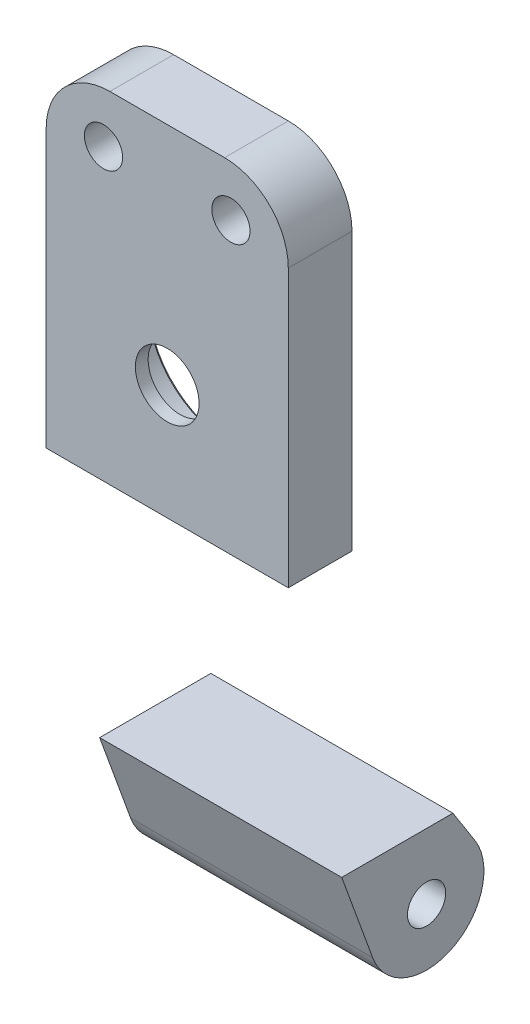
ISO-10303-21;
HEADER;
FILE_DESCRIPTION(('STEP AP214'),'2;1');
FILE_NAME('part.step','',(''),(''),'','','');
FILE_SCHEMA(('AUTOMOTIVE_DESIGN { 1 0 10303 214 1 1 1 1 }'));
ENDSEC;
DATA;
#1=APPLICATION_CONTEXT('core data for automotive mechanical design processes');
#2=APPLICATION_PROTOCOL_DEFINITION('international standard','automotive_design',2000,#1);
#3=PRODUCT_CONTEXT('',#1,'mechanical');
#4=PRODUCT('Part','Part','',(#3));
#5=PRODUCT_RELATED_PRODUCT_CATEGORY('part','',(#4));
#6=PRODUCT_DEFINITION_FORMATION('','',#4);
#7=PRODUCT_DEFINITION_CONTEXT('part definition',#1,'design');
#8=PRODUCT_DEFINITION('design','',#6,#7);
#9=PRODUCT_DEFINITION_SHAPE('','',#8);
#10=(LENGTH_UNIT() NAMED_UNIT(*) SI_UNIT(.MILLI.,.METRE.));
#11=(NAMED_UNIT(*) PLANE_ANGLE_UNIT() SI_UNIT($,.RADIAN.));
#12=(NAMED_UNIT(*) SI_UNIT($,.STERADIAN.) SOLID_ANGLE_UNIT());
#13=UNCERTAINTY_MEASURE_WITH_UNIT(LENGTH_MEASURE(1.E-05),#10,'distance_accuracy_value','');
#14=(GEOMETRIC_REPRESENTATION_CONTEXT(3) GLOBAL_UNCERTAINTY_ASSIGNED_CONTEXT((#13)) GLOBAL_UNIT_ASSIGNED_CONTEXT((#10,
#11,#12)) REPRESENTATION_CONTEXT('',''));
#15=CARTESIAN_POINT('',(0.,0.,0.));
#16=DIRECTION('',(0.,0.,1.));
#17=DIRECTION('',(1.,0.,0.));
#18=AXIS2_PLACEMENT_3D('',#15,#16,#17);
#19=CARTESIAN_POINT('',(9.5,1.73141540514422,17.5374143015117));
#20=DIRECTION('',(1.,0.,0.));
#21=DIRECTION('',(0.,1.,0.));
#22=AXIS2_PLACEMENT_3D('',#19,#20,#21);
#23=PLANE('',#22);
#24=DIRECTION('',(0.,0.,1.));
#25=VECTOR('',#24,1.);
#26=CARTESIAN_POINT('',(9.5,4.06933743514415,28.9300125427243));
#27=LINE('',#26,#25);
#28=CARTESIAN_POINT('',(9.5,4.06933743514415,20.2143094769658));
#29=VERTEX_POINT('',#28);
#30=CARTESIAN_POINT('',(9.5,4.06933743514415,25.2143094769658));
#31=VERTEX_POINT('',#30);
#32=EDGE_CURVE('E12',#29,#31,#27,.T.);
#33=ORIENTED_EDGE('',*,*,#32,.F.);
#34=DIRECTION('',(0.,-1.,0.));
#35=VECTOR('',#34,1.);
#36=CARTESIAN_POINT('',(9.5,7.91732382523638,20.2143094769658));
#37=LINE('',#36,#35);
#38=CARTESIAN_POINT('',(9.5,25.8080822959938,20.2143094769658));
#39=VERTEX_POINT('',#38);
#40=EDGE_CURVE('E111',#39,#29,#37,.T.);
#41=ORIENTED_EDGE('',*,*,#40,.F.);
#42=DIRECTION('',(0.,0.,1.));
#43=VECTOR('',#42,1.);
#44=CARTESIAN_POINT('',(9.5,25.8080822959938,17.5374143015117));
#45=LINE('',#44,#43);
#46=CARTESIAN_POINT('',(9.5,25.8080822959938,25.2143094769657));
#47=VERTEX_POINT('',#46);
#48=EDGE_CURVE('E131',#39,#47,#45,.T.);
#49=ORIENTED_EDGE('',*,*,#48,.T.);
#50=DIRECTION('',(0.,-1.,0.));
#51=VECTOR('',#50,1.);
#52=CARTESIAN_POINT('',(9.5,7.60659887027264,25.2143094769657));
#53=LINE('',#52,#51);
#54=EDGE_CURVE('E113',#47,#31,#53,.T.);
#55=ORIENTED_EDGE('',*,*,#54,.T.);
#56=EDGE_LOOP('',(#33,#41,#49,#55));
#57=FACE_BOUND('',#56,.T.);
#58=ADVANCED_FACE('F50',(#57),#23,.T.);
#59=CARTESIAN_POINT('',(-9.5,1.73141540514422,17.5374143015117));
#60=DIRECTION('',(1.,0.,0.));
#61=DIRECTION('',(0.,1.,0.));
#62=AXIS2_PLACEMENT_3D('',#59,#60,#61);
#63=PLANE('',#62);
#64=DIRECTION('',(0.,-1.,0.));
#65=VECTOR('',#64,1.);
#66=CARTESIAN_POINT('',(-9.5,7.91732382523638,20.2143094769658));
#67=LINE('',#66,#65);
#68=CARTESIAN_POINT('',(-9.5,25.8080822959938,20.2143094769658));
#69=VERTEX_POINT('',#68);
#70=CARTESIAN_POINT('',(-9.5,4.06933743514415,20.2143094769658));
#71=VERTEX_POINT('',#70);
#72=EDGE_CURVE('E128',#69,#71,#67,.T.);
#73=ORIENTED_EDGE('',*,*,#72,.T.);
#74=DIRECTION('',(0.,0.,1.));
#75=VECTOR('',#74,1.);
#76=CARTESIAN_POINT('',(-9.5,4.06933743514415,17.5374143015117));
#77=LINE('',#76,#75);
#78=CARTESIAN_POINT('',(-9.5,4.06933743514415,25.2143094769657));
#79=VERTEX_POINT('',#78);
#80=EDGE_CURVE('E100',#71,#79,#77,.T.);
#81=ORIENTED_EDGE('',*,*,#80,.T.);
#82=DIRECTION('',(0.,-1.,0.));
#83=VECTOR('',#82,1.);
#84=CARTESIAN_POINT('',(-9.5,7.60659887027264,25.2143094769657));
#85=LINE('',#84,#83);
#86=CARTESIAN_POINT('',(-9.5,25.8080822959938,25.2143094769657));
#87=VERTEX_POINT('',#86);
#88=EDGE_CURVE('E148',#87,#79,#85,.T.);
#89=ORIENTED_EDGE('',*,*,#88,.F.);
#90=DIRECTION('',(0.,0.,-1.));
#91=VECTOR('',#90,1.);
#92=CARTESIAN_POINT('',(-9.5,25.8080822959938,20.2143094769658));
#93=LINE('',#92,#91);
#94=EDGE_CURVE('E156',#87,#69,#93,.T.);
#95=ORIENTED_EDGE('',*,*,#94,.T.);
#96=EDGE_LOOP('',(#73,#81,#89,#95));
#97=FACE_BOUND('',#96,.T.);
#98=ADVANCED_FACE('F194',(#97),#63,.F.);
#99=CARTESIAN_POINT('',(0.,13.1015537091819,20.7143094769658));
#100=DIRECTION('',(0.,0.,-1.));
#101=DIRECTION('',(-1.,0.,0.));
#102=AXIS2_PLACEMENT_3D('',#99,#100,#101);
#103=CONICAL_SURFACE('',#102,6.,0.785398163397448);
#104=CARTESIAN_POINT('',(0.,13.1015537091819,20.2143094769658));
#105=DIRECTION('',(0.,0.,1.));
#106=DIRECTION('',(-1.,0.,0.));
#107=AXIS2_PLACEMENT_3D('',#104,#105,#106);
#108=CIRCLE('',#107,6.5);
#109=CARTESIAN_POINT('',(-6.5,13.1015537091819,20.2143094769658));
#110=VERTEX_POINT('',#109);
#111=EDGE_CURVE('E119',#110,#110,#108,.T.);
#112=ORIENTED_EDGE('',*,*,#111,.F.);
#113=EDGE_LOOP('',(#112));
#114=FACE_BOUND('',#113,.T.);
#115=CARTESIAN_POINT('',(0.,13.1015537091819,20.4643094769658));
#116=DIRECTION('',(0.,0.,-1.));
#117=DIRECTION('',(-1.,0.,0.));
#118=AXIS2_PLACEMENT_3D('',#115,#116,#117);
#119=CIRCLE('',#118,6.25);
#120=CARTESIAN_POINT('',(-6.25,13.1015537091819,20.4643094769658));
#121=VERTEX_POINT('',#120);
#122=EDGE_CURVE('E139',#121,#121,#119,.T.);
#123=ORIENTED_EDGE('',*,*,#122,.F.);
#124=EDGE_LOOP('',(#123));
#125=FACE_BOUND('',#124,.T.);
#126=ADVANCED_FACE('F196',(#114,#125),#103,.F.);
#127=CARTESIAN_POINT('',(9.5,7.60659887027264,25.2143094769657));
#128=DIRECTION('',(0.,0.,-1.));
#129=DIRECTION('',(-1.,0.,0.));
#130=AXIS2_PLACEMENT_3D('',#127,#128,#129);
#131=PLANE('',#130);
#132=CARTESIAN_POINT('',(-5.,26.8080822959938,25.2143094769657));
#133=DIRECTION('',(0.,0.,1.));
#134=DIRECTION('',(1.,0.,0.));
#135=AXIS2_PLACEMENT_3D('',#132,#133,#134);
#136=CIRCLE('',#135,1.5);
#137=CARTESIAN_POINT('',(-3.5,26.8080822959938,25.2143094769657));
#138=VERTEX_POINT('',#137);
#139=EDGE_CURVE('E107',#138,#138,#136,.T.);
#140=ORIENTED_EDGE('',*,*,#139,.F.);
#141=EDGE_LOOP('',(#140));
#142=FACE_BOUND('',#141,.T.);
#143=CARTESIAN_POINT('',(5.,26.8080822959938,25.2143094769657));
#144=DIRECTION('',(0.,0.,1.));
#145=DIRECTION('',(1.,0.,0.));
#146=AXIS2_PLACEMENT_3D('',#143,#144,#145);
#147=CIRCLE('',#146,1.5);
#148=CARTESIAN_POINT('',(6.5,26.8080822959938,25.2143094769657));
#149=VERTEX_POINT('',#148);
#150=EDGE_CURVE('E140',#149,#149,#147,.T.);
#151=ORIENTED_EDGE('',*,*,#150,.F.);
#152=EDGE_LOOP('',(#151));
#153=FACE_BOUND('',#152,.T.);
#154=CARTESIAN_POINT('',(0.,13.1015537091819,25.2143094769657));
#155=DIRECTION('',(0.,0.,-1.));
#156=DIRECTION('',(0.,1.,0.));
#157=AXIS2_PLACEMENT_3D('',#154,#155,#156);
#158=CIRCLE('',#157,2.5);
#159=CARTESIAN_POINT('',(0.,15.6015537091819,25.2143094769657));
#160=VERTEX_POINT('',#159);
#161=EDGE_CURVE('E152',#160,#160,#158,.T.);
#162=ORIENTED_EDGE('',*,*,#161,.T.);
#163=EDGE_LOOP('',(#162));
#164=FACE_BOUND('',#163,.T.);
#165=ORIENTED_EDGE('',*,*,#88,.T.);
#166=DIRECTION('',(1.,0.,0.));
#167=VECTOR('',#166,1.);
#168=CARTESIAN_POINT('',(9.5,4.06933743514415,25.2143094769657));
#169=LINE('',#168,#167);
#170=EDGE_CURVE('E65',#79,#31,#169,.T.);
#171=ORIENTED_EDGE('',*,*,#170,.T.);
#172=ORIENTED_EDGE('',*,*,#54,.F.);
#173=CARTESIAN_POINT('',(4.5,25.8080822959938,25.2143094769657));
#174=DIRECTION('',(0.,0.,1.));
#175=DIRECTION('',(0.,1.,0.));
#176=AXIS2_PLACEMENT_3D('',#173,#174,#175);
#177=CIRCLE('',#176,5.);
#178=CARTESIAN_POINT('',(4.5,30.8080822959938,25.2143094769657));
#179=VERTEX_POINT('',#178);
#180=EDGE_CURVE('E147',#47,#179,#177,.T.);
#181=ORIENTED_EDGE('',*,*,#180,.T.);
#182=DIRECTION('',(-1.,0.,0.));
#183=VECTOR('',#182,1.);
#184=CARTESIAN_POINT('',(9.5,30.8080822959938,25.2143094769657));
#185=LINE('',#184,#183);
#186=CARTESIAN_POINT('',(-4.5,30.8080822959938,25.2143094769657));
#187=VERTEX_POINT('',#186);
#188=EDGE_CURVE('E151',#179,#187,#185,.T.);
#189=ORIENTED_EDGE('',*,*,#188,.T.);
#190=CARTESIAN_POINT('',(-4.5,25.8080822959938,25.2143094769657));
#191=DIRECTION('',(0.,0.,1.));
#192=DIRECTION('',(0.,1.,0.));
#193=AXIS2_PLACEMENT_3D('',#190,#191,#192);
#194=CIRCLE('',#193,5.);
#195=EDGE_CURVE('E175',#187,#87,#194,.T.);
#196=ORIENTED_EDGE('',*,*,#195,.T.);
#197=EDGE_LOOP('',(#165,#171,#172,#181,#189,#196));
#198=FACE_BOUND('',#197,.T.);
#199=ADVANCED_FACE('F169',(#142,#153,#164,#198),#131,.F.);
#200=CARTESIAN_POINT('',(9.5,7.91732382523638,20.2143094769658));
#201=DIRECTION('',(0.,0.,-1.));
#202=DIRECTION('',(0.,-1.,0.));
#203=AXIS2_PLACEMENT_3D('',#200,#201,#202);
#204=PLANE('',#203);
#205=DIRECTION('',(1.,0.,0.));
#206=VECTOR('',#205,1.);
#207=CARTESIAN_POINT('',(9.5,4.06933743514415,20.2143094769658));
#208=LINE('',#207,#206);
#209=EDGE_CURVE('E58',#71,#29,#208,.T.);
#210=ORIENTED_EDGE('',*,*,#209,.F.);
#211=ORIENTED_EDGE('',*,*,#72,.F.);
#212=CARTESIAN_POINT('',(-4.5,25.8080822959938,20.2143094769658));
#213=DIRECTION('',(0.,0.,-1.));
#214=DIRECTION('',(-1.,0.,0.));
#215=AXIS2_PLACEMENT_3D('',#212,#213,#214);
#216=CIRCLE('',#215,5.);
#217=CARTESIAN_POINT('',(-4.5,30.8080822959938,20.2143094769658));
#218=VERTEX_POINT('',#217);
#219=EDGE_CURVE('E124',#69,#218,#216,.T.);
#220=ORIENTED_EDGE('',*,*,#219,.T.);
#221=DIRECTION('',(-1.,0.,0.));
#222=VECTOR('',#221,1.);
#223=CARTESIAN_POINT('',(9.5,30.8080822959938,20.2143094769658));
#224=LINE('',#223,#222);
#225=CARTESIAN_POINT('',(4.5,30.8080822959938,20.2143094769658));
#226=VERTEX_POINT('',#225);
#227=EDGE_CURVE('E122',#226,#218,#224,.T.);
#228=ORIENTED_EDGE('',*,*,#227,.F.);
#229=CARTESIAN_POINT('',(4.5,25.8080822959938,20.2143094769658));
#230=DIRECTION('',(0.,0.,-1.));
#231=DIRECTION('',(-1.,0.,0.));
#232=AXIS2_PLACEMENT_3D('',#229,#230,#231);
#233=CIRCLE('',#232,5.);
#234=EDGE_CURVE('E117',#226,#39,#233,.T.);
#235=ORIENTED_EDGE('',*,*,#234,.T.);
#236=ORIENTED_EDGE('',*,*,#40,.T.);
#237=EDGE_LOOP('',(#210,#211,#220,#228,#235,#236));
#238=FACE_BOUND('',#237,.T.);
#239=CARTESIAN_POINT('',(-5.,26.8080822959938,20.2143094769658));
#240=DIRECTION('',(0.,0.,-1.));
#241=DIRECTION('',(-1.,0.,0.));
#242=AXIS2_PLACEMENT_3D('',#239,#240,#241);
#243=CIRCLE('',#242,1.5);
#244=CARTESIAN_POINT('',(-6.5,26.8080822959938,20.2143094769658));
#245=VERTEX_POINT('',#244);
#246=EDGE_CURVE('E143',#245,#245,#243,.T.);
#247=ORIENTED_EDGE('',*,*,#246,.F.);
#248=EDGE_LOOP('',(#247));
#249=FACE_BOUND('',#248,.T.);
#250=CARTESIAN_POINT('',(5.,26.8080822959938,20.2143094769658));
#251=DIRECTION('',(0.,0.,-1.));
#252=DIRECTION('',(-1.,0.,0.));
#253=AXIS2_PLACEMENT_3D('',#250,#251,#252);
#254=CIRCLE('',#253,1.5);
#255=CARTESIAN_POINT('',(3.5,26.8080822959938,20.2143094769658));
#256=VERTEX_POINT('',#255);
#257=EDGE_CURVE('E144',#256,#256,#254,.T.);
#258=ORIENTED_EDGE('',*,*,#257,.F.);
#259=EDGE_LOOP('',(#258));
#260=FACE_BOUND('',#259,.T.);
#261=ORIENTED_EDGE('',*,*,#111,.T.);
#262=EDGE_LOOP('',(#261));
#263=FACE_BOUND('',#262,.T.);
#264=ADVANCED_FACE('F114',(#238,#249,#260,#263),#204,.T.);
#265=CARTESIAN_POINT('',(9.5,30.8080822959938,22.7143094769658));
#266=DIRECTION('',(0.,1.,0.));
#267=DIRECTION('',(1.,0.,0.));
#268=AXIS2_PLACEMENT_3D('',#265,#266,#267);
#269=PLANE('',#268);
#270=ORIENTED_EDGE('',*,*,#227,.T.);
#271=DIRECTION('',(0.,0.,1.));
#272=VECTOR('',#271,1.);
#273=CARTESIAN_POINT('',(-4.5,30.8080822959938,25.2143094769657));
#274=LINE('',#273,#272);
#275=EDGE_CURVE('E174',#218,#187,#274,.T.);
#276=ORIENTED_EDGE('',*,*,#275,.T.);
#277=ORIENTED_EDGE('',*,*,#188,.F.);
#278=DIRECTION('',(0.,0.,-1.));
#279=VECTOR('',#278,1.);
#280=CARTESIAN_POINT('',(4.5,30.8080822959938,22.7143094769658));
#281=LINE('',#280,#279);
#282=EDGE_CURVE('E136',#179,#226,#281,.T.);
#283=ORIENTED_EDGE('',*,*,#282,.T.);
#284=EDGE_LOOP('',(#270,#276,#277,#283));
#285=FACE_BOUND('',#284,.T.);
#286=ADVANCED_FACE('F172',(#285),#269,.T.);
#287=CARTESIAN_POINT('',(-4.5,25.8080822959938,17.5374143015117));
#288=DIRECTION('',(0.,0.,1.));
#289=DIRECTION('',(1.,0.,0.));
#290=AXIS2_PLACEMENT_3D('',#287,#288,#289);
#291=CYLINDRICAL_SURFACE('',#290,5.);
#292=ORIENTED_EDGE('',*,*,#195,.F.);
#293=ORIENTED_EDGE('',*,*,#275,.F.);
#294=ORIENTED_EDGE('',*,*,#219,.F.);
#295=ORIENTED_EDGE('',*,*,#94,.F.);
#296=EDGE_LOOP('',(#292,#293,#294,#295));
#297=FACE_BOUND('',#296,.T.);
#298=ADVANCED_FACE('F183',(#297),#291,.T.);
#299=CARTESIAN_POINT('',(4.5,25.8080822959938,22.7143094769658));
#300=DIRECTION('',(0.,0.,-1.));
#301=DIRECTION('',(-1.,0.,0.));
#302=AXIS2_PLACEMENT_3D('',#299,#300,#301);
#303=CYLINDRICAL_SURFACE('',#302,5.);
#304=ORIENTED_EDGE('',*,*,#180,.F.);
#305=ORIENTED_EDGE('',*,*,#48,.F.);
#306=ORIENTED_EDGE('',*,*,#234,.F.);
#307=ORIENTED_EDGE('',*,*,#282,.F.);
#308=EDGE_LOOP('',(#304,#305,#306,#307));
#309=FACE_BOUND('',#308,.T.);
#310=ADVANCED_FACE('F164',(#309),#303,.T.);
#311=CARTESIAN_POINT('',(0.,13.1015537091819,16.5143094769657));
#312=DIRECTION('',(0.,0.,1.));
#313=DIRECTION('',(1.,0.,0.));
#314=AXIS2_PLACEMENT_3D('',#311,#312,#313);
#315=CYLINDRICAL_SURFACE('',#314,2.5);
#316=ORIENTED_EDGE('',*,*,#161,.F.);
#317=EDGE_LOOP('',(#316));
#318=FACE_BOUND('',#317,.T.);
#319=CARTESIAN_POINT('',(0.,13.1015537091819,24.2143094769658));
#320=DIRECTION('',(0.,0.,-1.));
#321=DIRECTION('',(-1.,0.,0.));
#322=AXIS2_PLACEMENT_3D('',#319,#320,#321);
#323=CIRCLE('',#322,2.5);
#324=CARTESIAN_POINT('',(-2.5,13.1015537091819,24.2143094769658));
#325=VERTEX_POINT('',#324);
#326=EDGE_CURVE('E132',#325,#325,#323,.T.);
#327=ORIENTED_EDGE('',*,*,#326,.T.);
#328=EDGE_LOOP('',(#327));
#329=FACE_BOUND('',#328,.T.);
#330=ADVANCED_FACE('F221',(#318,#329),#315,.F.);
#331=CARTESIAN_POINT('',(0.,13.1015537091819,24.2143094769658));
#332=DIRECTION('',(0.,0.,-1.));
#333=DIRECTION('',(-1.,0.,0.));
#334=AXIS2_PLACEMENT_3D('',#331,#332,#333);
#335=PLANE('',#334);
#336=ORIENTED_EDGE('',*,*,#326,.F.);
#337=EDGE_LOOP('',(#336));
#338=FACE_BOUND('',#337,.T.);
#339=CARTESIAN_POINT('',(0.,13.1015537091819,24.2143094769658));
#340=DIRECTION('',(0.,0.,-1.));
#341=DIRECTION('',(-1.,0.,0.));
#342=AXIS2_PLACEMENT_3D('',#339,#340,#341);
#343=CIRCLE('',#342,6.25);
#344=CARTESIAN_POINT('',(-6.25,13.1015537091819,24.2143094769658));
#345=VERTEX_POINT('',#344);
#346=EDGE_CURVE('E135',#345,#345,#343,.T.);
#347=ORIENTED_EDGE('',*,*,#346,.T.);
#348=EDGE_LOOP('',(#347));
#349=FACE_BOUND('',#348,.T.);
#350=ADVANCED_FACE('F217',(#338,#349),#335,.T.);
#351=CARTESIAN_POINT('',(0.,13.1015537091819,9.8605191260576));
#352=DIRECTION('',(0.,0.,1.));
#353=DIRECTION('',(1.,0.,0.));
#354=AXIS2_PLACEMENT_3D('',#351,#352,#353);
#355=CYLINDRICAL_SURFACE('',#354,6.25);
#356=ORIENTED_EDGE('',*,*,#346,.F.);
#357=EDGE_LOOP('',(#356));
#358=FACE_BOUND('',#357,.T.);
#359=ORIENTED_EDGE('',*,*,#122,.T.);
#360=EDGE_LOOP('',(#359));
#361=FACE_BOUND('',#360,.T.);
#362=ADVANCED_FACE('F213',(#358,#361),#355,.F.);
#363=CARTESIAN_POINT('',(5.,26.8080822959938,15.2143094769657));
#364=DIRECTION('',(0.,0.,1.));
#365=DIRECTION('',(1.,0.,0.));
#366=AXIS2_PLACEMENT_3D('',#363,#364,#365);
#367=CYLINDRICAL_SURFACE('',#366,1.5);
#368=ORIENTED_EDGE('',*,*,#257,.T.);
#369=EDGE_LOOP('',(#368));
#370=FACE_BOUND('',#369,.T.);
#371=ORIENTED_EDGE('',*,*,#150,.T.);
#372=EDGE_LOOP('',(#371));
#373=FACE_BOUND('',#372,.T.);
#374=ADVANCED_FACE('F209',(#370,#373),#367,.F.);
#375=CARTESIAN_POINT('',(-5.,26.8080822959938,15.2143094769657));
#376=DIRECTION('',(0.,0.,1.));
#377=DIRECTION('',(1.,0.,0.));
#378=AXIS2_PLACEMENT_3D('',#375,#376,#377);
#379=CYLINDRICAL_SURFACE('',#378,1.5);
#380=ORIENTED_EDGE('',*,*,#246,.T.);
#381=EDGE_LOOP('',(#380));
#382=FACE_BOUND('',#381,.T.);
#383=ORIENTED_EDGE('',*,*,#139,.T.);
#384=EDGE_LOOP('',(#383));
#385=FACE_BOUND('',#384,.T.);
#386=ADVANCED_FACE('F206',(#382,#385),#379,.F.);
#387=CARTESIAN_POINT('',(-9.5,4.06933743514415,28.9300125427243));
#388=DIRECTION('',(0.,1.,0.));
#389=DIRECTION('',(0.,0.,1.));
#390=AXIS2_PLACEMENT_3D('',#387,#388,#389);
#391=PLANE('',#390);
#392=ORIENTED_EDGE('',*,*,#80,.F.);
#393=ORIENTED_EDGE('',*,*,#209,.T.);
#394=ORIENTED_EDGE('',*,*,#32,.T.);
#395=ORIENTED_EDGE('',*,*,#170,.F.);
#396=EDGE_LOOP('',(#392,#393,#394,#395));
#397=FACE_BOUND('',#396,.T.);
#398=ADVANCED_FACE('F103',(#397),#391,.F.);
#399=CLOSED_SHELL('',(#58,#98,#126,#199,#264,#286,#298,#310,#330,#350,#362,#374,#386,#398));
#400=MANIFOLD_SOLID_BREP('B2',#399);
#401=CARTESIAN_POINT('',(17.278174593052,-22.8452514857054,14.3605191260576));
#402=DIRECTION('',(-1.,0.,0.));
#403=DIRECTION('',(0.,0.,1.));
#404=AXIS2_PLACEMENT_3D('',#401,#402,#403);
#405=CYLINDRICAL_SURFACE('',#404,1.5);
#406=CARTESIAN_POINT('',(-9.5,-22.8452514857054,14.3605191260576));
#407=DIRECTION('',(-1.,0.,0.));
#408=DIRECTION('',(0.,0.,1.));
#409=AXIS2_PLACEMENT_3D('',#406,#407,#408);
#410=CIRCLE('',#409,1.5);
#411=CARTESIAN_POINT('',(-9.5,-22.8452514857054,15.8605191260576));
#412=VERTEX_POINT('',#411);
#413=EDGE_CURVE('E402',#412,#412,#410,.T.);
#414=ORIENTED_EDGE('',*,*,#413,.T.);
#415=EDGE_LOOP('',(#414));
#416=FACE_BOUND('',#415,.T.);
#417=CARTESIAN_POINT('',(9.5,-22.8452514857054,14.3605191260576));
#418=DIRECTION('',(1.,0.,0.));
#419=DIRECTION('',(0.,0.,-1.));
#420=AXIS2_PLACEMENT_3D('',#417,#418,#419);
#421=CIRCLE('',#420,1.5);
#422=CARTESIAN_POINT('',(9.5,-22.8452514857054,12.8605191260576));
#423=VERTEX_POINT('',#422);
#424=EDGE_CURVE('E418',#423,#423,#421,.F.);
#425=ORIENTED_EDGE('',*,*,#424,.F.);
#426=EDGE_LOOP('',(#425));
#427=FACE_BOUND('',#426,.T.);
#428=ADVANCED_FACE('F350',(#416,#427),#405,.F.);
#429=CARTESIAN_POINT('',(9.5,-22.8452514857054,14.3605191260576));
#430=DIRECTION('',(-1.,0.,0.));
#431=DIRECTION('',(0.,0.,1.));
#432=AXIS2_PLACEMENT_3D('',#429,#430,#431);
#433=CYLINDRICAL_SURFACE('',#432,4.5);
#434=CARTESIAN_POINT('',(-9.5,-22.8452514857054,14.3605191260576));
#435=DIRECTION('',(1.,0.,0.));
#436=DIRECTION('',(0.,0.,-1.));
#437=AXIS2_PLACEMENT_3D('',#434,#435,#436);
#438=CIRCLE('',#437,4.5);
#439=CARTESIAN_POINT('',(-9.5,-24.3843421306709,18.5891359195942));
#440=VERTEX_POINT('',#439);
#441=CARTESIAN_POINT('',(-9.5,-20.4343265102656,10.5608558827161));
#442=VERTEX_POINT('',#441);
#443=EDGE_CURVE('E412',#440,#442,#438,.T.);
#444=ORIENTED_EDGE('',*,*,#443,.T.);
#445=DIRECTION('',(-1.,0.,0.));
#446=VECTOR('',#445,1.);
#447=CARTESIAN_POINT('',(9.5,-20.4343265102656,10.5608558827161));
#448=LINE('',#447,#446);
#449=CARTESIAN_POINT('',(9.5,-20.4343265102656,10.5608558827161));
#450=VERTEX_POINT('',#449);
#451=EDGE_CURVE('E420',#450,#442,#448,.T.);
#452=ORIENTED_EDGE('',*,*,#451,.F.);
#453=CARTESIAN_POINT('',(9.5,-22.8452514857054,14.3605191260576));
#454=DIRECTION('',(1.,0.,0.));
#455=DIRECTION('',(0.,0.,-1.));
#456=AXIS2_PLACEMENT_3D('',#453,#454,#455);
#457=CIRCLE('',#456,4.5);
#458=CARTESIAN_POINT('',(9.5,-24.3843421306709,18.5891359195942));
#459=VERTEX_POINT('',#458);
#460=EDGE_CURVE('E422',#459,#450,#457,.T.);
#461=ORIENTED_EDGE('',*,*,#460,.F.);
#462=DIRECTION('',(-1.,0.,0.));
#463=VECTOR('',#462,1.);
#464=CARTESIAN_POINT('',(9.5,-24.3843421306709,18.5891359195942));
#465=LINE('',#464,#463);
#466=EDGE_CURVE('E411',#459,#440,#465,.T.);
#467=ORIENTED_EDGE('',*,*,#466,.T.);
#468=EDGE_LOOP('',(#444,#452,#461,#467));
#469=FACE_BOUND('',#468,.T.);
#470=ADVANCED_FACE('F427',(#469),#433,.T.);
#471=CARTESIAN_POINT('',(-9.5,1.73141540514422,17.5374143015117));
#472=DIRECTION('',(1.,0.,0.));
#473=DIRECTION('',(0.,1.,0.));
#474=AXIS2_PLACEMENT_3D('',#471,#472,#473);
#475=PLANE('',#474);
#476=DIRECTION('',(0.,0.939692620785908,0.342020143325669));
#477=VECTOR('',#476,1.);
#478=CARTESIAN_POINT('',(-9.5,-16.0287039880252,21.6303394918166));
#479=LINE('',#478,#477);
#480=CARTESIAN_POINT('',(-9.5,-17.70760064817,21.0192710811149));
#481=VERTEX_POINT('',#480);
#482=EDGE_CURVE('E373',#440,#481,#479,.T.);
#483=ORIENTED_EDGE('',*,*,#482,.T.);
#484=DIRECTION('',(0.,0.,-1.));
#485=VECTOR('',#484,1.);
#486=CARTESIAN_POINT('',(-9.5,-17.70760064817,17.5374143015117));
#487=LINE('',#486,#485);
#488=CARTESIAN_POINT('',(-9.5,-17.70760064817,12.2909911765804));
#489=VERTEX_POINT('',#488);
#490=EDGE_CURVE('E48',#481,#489,#487,.T.);
#491=ORIENTED_EDGE('',*,*,#490,.T.);
#492=DIRECTION('',(0.,-0.844369609631453,-0.535761105653282));
#493=VECTOR('',#492,1.);
#494=CARTESIAN_POINT('',(-9.5,-14.0536961778226,14.6094307279982));
#495=LINE('',#494,#493);
#496=EDGE_CURVE('E384',#489,#442,#495,.T.);
#497=ORIENTED_EDGE('',*,*,#496,.T.);
#498=ORIENTED_EDGE('',*,*,#443,.F.);
#499=EDGE_LOOP('',(#483,#491,#497,#498));
#500=FACE_BOUND('',#499,.T.);
#501=ORIENTED_EDGE('',*,*,#413,.F.);
#502=EDGE_LOOP('',(#501));
#503=FACE_BOUND('',#502,.T.);
#504=ADVANCED_FACE('F429',(#500,#503),#475,.F.);
#505=CARTESIAN_POINT('',(9.5,1.73141540514422,17.5374143015117));
#506=DIRECTION('',(1.,0.,0.));
#507=DIRECTION('',(0.,1.,0.));
#508=AXIS2_PLACEMENT_3D('',#505,#506,#507);
#509=PLANE('',#508);
#510=DIRECTION('',(0.,0.,-1.));
#511=VECTOR('',#510,1.);
#512=CARTESIAN_POINT('',(9.5,-17.70760064817,28.9300125427243));
#513=LINE('',#512,#511);
#514=CARTESIAN_POINT('',(9.5,-17.70760064817,21.0192710811149));
#515=VERTEX_POINT('',#514);
#516=CARTESIAN_POINT('',(9.5,-17.70760064817,12.2909911765804));
#517=VERTEX_POINT('',#516);
#518=EDGE_CURVE('E400',#515,#517,#513,.T.);
#519=ORIENTED_EDGE('',*,*,#518,.F.);
#520=DIRECTION('',(0.,0.939692620785908,0.342020143325669));
#521=VECTOR('',#520,1.);
#522=CARTESIAN_POINT('',(9.5,-16.0287039880252,21.6303394918166));
#523=LINE('',#522,#521);
#524=EDGE_CURVE('E358',#459,#515,#523,.T.);
#525=ORIENTED_EDGE('',*,*,#524,.F.);
#526=ORIENTED_EDGE('',*,*,#460,.T.);
#527=DIRECTION('',(0.,-0.844369609631453,-0.535761105653282));
#528=VECTOR('',#527,1.);
#529=CARTESIAN_POINT('',(9.5,-14.0536961778226,14.6094307279982));
#530=LINE('',#529,#528);
#531=EDGE_CURVE('E390',#517,#450,#530,.T.);
#532=ORIENTED_EDGE('',*,*,#531,.F.);
#533=EDGE_LOOP('',(#519,#525,#526,#532));
#534=FACE_BOUND('',#533,.T.);
#535=ORIENTED_EDGE('',*,*,#424,.T.);
#536=EDGE_LOOP('',(#535));
#537=FACE_BOUND('',#536,.T.);
#538=ADVANCED_FACE('F406',(#534,#537),#509,.T.);
#539=CARTESIAN_POINT('',(9.5,-14.0536961778226,14.6094307279982));
#540=DIRECTION('',(0.,0.535761105653282,-0.844369609631453));
#541=DIRECTION('',(-1.,0.,0.));
#542=AXIS2_PLACEMENT_3D('',#539,#540,#541);
#543=PLANE('',#542);
#544=DIRECTION('',(-1.,0.,0.));
#545=VECTOR('',#544,1.);
#546=CARTESIAN_POINT('',(9.5,-17.70760064817,12.2909911765804));
#547=LINE('',#546,#545);
#548=EDGE_CURVE('E365',#517,#489,#547,.T.);
#549=ORIENTED_EDGE('',*,*,#548,.F.);
#550=ORIENTED_EDGE('',*,*,#531,.T.);
#551=ORIENTED_EDGE('',*,*,#451,.T.);
#552=ORIENTED_EDGE('',*,*,#496,.F.);
#553=EDGE_LOOP('',(#549,#550,#551,#552));
#554=FACE_BOUND('',#553,.T.);
#555=ADVANCED_FACE('F352',(#554),#543,.T.);
#556=CARTESIAN_POINT('',(9.5,-16.0287039880252,21.6303394918166));
#557=DIRECTION('',(0.,-0.342020143325669,0.939692620785908));
#558=DIRECTION('',(-1.,0.,0.));
#559=AXIS2_PLACEMENT_3D('',#556,#557,#558);
#560=PLANE('',#559);
#561=DIRECTION('',(1.,0.,0.));
#562=VECTOR('',#561,1.);
#563=CARTESIAN_POINT('',(9.5,-17.70760064817,21.0192710811149));
#564=LINE('',#563,#562);
#565=EDGE_CURVE('E397',#481,#515,#564,.T.);
#566=ORIENTED_EDGE('',*,*,#565,.F.);
#567=ORIENTED_EDGE('',*,*,#482,.F.);
#568=ORIENTED_EDGE('',*,*,#466,.F.);
#569=ORIENTED_EDGE('',*,*,#524,.T.);
#570=EDGE_LOOP('',(#566,#567,#568,#569));
#571=FACE_BOUND('',#570,.T.);
#572=ADVANCED_FACE('F410',(#571),#560,.T.);
#573=CARTESIAN_POINT('',(-9.5,-17.70760064817,28.9300125427243));
#574=DIRECTION('',(0.,-1.,0.));
#575=DIRECTION('',(0.,0.,-1.));
#576=AXIS2_PLACEMENT_3D('',#573,#574,#575);
#577=PLANE('',#576);
#578=ORIENTED_EDGE('',*,*,#565,.T.);
#579=ORIENTED_EDGE('',*,*,#518,.T.);
#580=ORIENTED_EDGE('',*,*,#548,.T.);
#581=ORIENTED_EDGE('',*,*,#490,.F.);
#582=EDGE_LOOP('',(#578,#579,#580,#581));
#583=FACE_BOUND('',#582,.T.);
#584=ADVANCED_FACE('F399',(#583),#577,.F.);
#585=CLOSED_SHELL('',(#428,#470,#504,#538,#555,#572,#584));
#586=MANIFOLD_SOLID_BREP('B6',#585);
#587=ADVANCED_BREP_SHAPE_REPRESENTATION('',(#18,#400,#586),#14);
#588=SHAPE_DEFINITION_REPRESENTATION(#9,#587);
ENDSEC;
END-ISO-10303-21;
